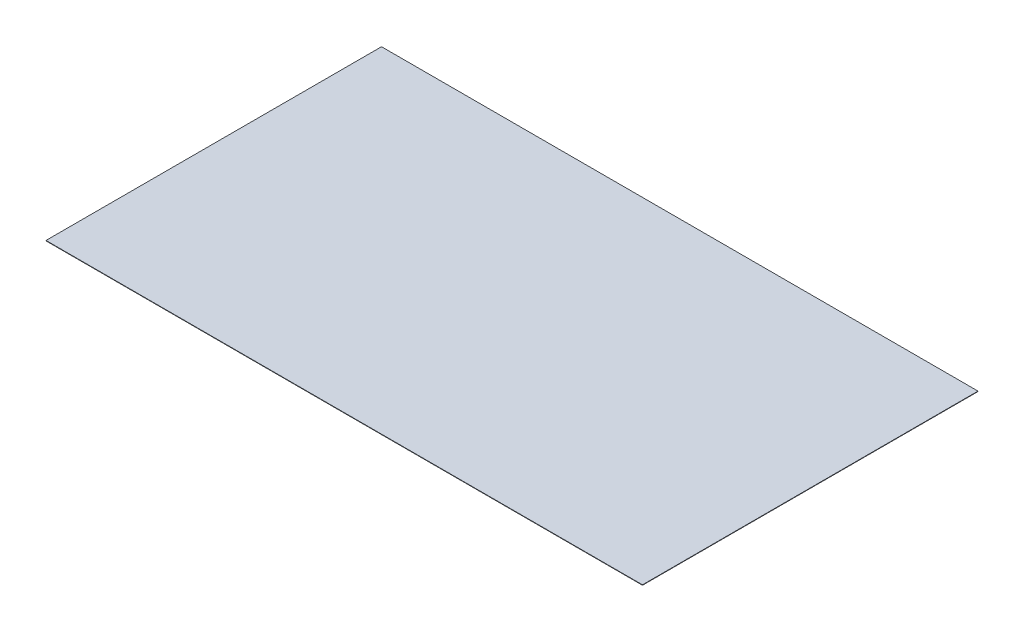
ISO-10303-21;
HEADER;
FILE_DESCRIPTION(('STEP AP214'),'2;1');
FILE_NAME('part.step','',(''),(''),'','','');
FILE_SCHEMA(('AUTOMOTIVE_DESIGN { 1 0 10303 214 1 1 1 1 }'));
ENDSEC;
DATA;
#1=APPLICATION_CONTEXT('core data for automotive mechanical design processes');
#2=APPLICATION_PROTOCOL_DEFINITION('international standard','automotive_design',2000,#1);
#3=PRODUCT_CONTEXT('',#1,'mechanical');
#4=PRODUCT('Part','Part','',(#3));
#5=PRODUCT_RELATED_PRODUCT_CATEGORY('part','',(#4));
#6=PRODUCT_DEFINITION_FORMATION('','',#4);
#7=PRODUCT_DEFINITION_CONTEXT('part definition',#1,'design');
#8=PRODUCT_DEFINITION('design','',#6,#7);
#9=PRODUCT_DEFINITION_SHAPE('','',#8);
#10=(LENGTH_UNIT() NAMED_UNIT(*) SI_UNIT(.MILLI.,.METRE.));
#11=(NAMED_UNIT(*) PLANE_ANGLE_UNIT() SI_UNIT($,.RADIAN.));
#12=(NAMED_UNIT(*) SI_UNIT($,.STERADIAN.) SOLID_ANGLE_UNIT());
#13=UNCERTAINTY_MEASURE_WITH_UNIT(LENGTH_MEASURE(1.E-05),#10,'distance_accuracy_value','');
#14=(GEOMETRIC_REPRESENTATION_CONTEXT(3) GLOBAL_UNCERTAINTY_ASSIGNED_CONTEXT((#13)) GLOBAL_UNIT_ASSIGNED_CONTEXT((#10,
#11,#12)) REPRESENTATION_CONTEXT('',''));
#15=CARTESIAN_POINT('',(0.,0.,0.));
#16=DIRECTION('',(0.,0.,1.));
#17=DIRECTION('',(1.,0.,0.));
#18=AXIS2_PLACEMENT_3D('',#15,#16,#17);
#19=CARTESIAN_POINT('',(0.,2.54,0.));
#20=DIRECTION('',(1.,0.,0.));
#21=DIRECTION('',(0.,0.,-1.));
#22=AXIS2_PLACEMENT_3D('',#19,#20,#21);
#23=PLANE('',#22);
#24=DIRECTION('',(0.,0.,1.));
#25=VECTOR('',#24,1.);
#26=CARTESIAN_POINT('',(0.,0.,0.));
#27=LINE('',#26,#25);
#28=CARTESIAN_POINT('',(0.,0.,0.));
#29=VERTEX_POINT('',#28);
#30=CARTESIAN_POINT('',(2.51958832456576E-13,0.,2057.4));
#31=VERTEX_POINT('',#30);
#32=EDGE_CURVE('E96',#29,#31,#27,.T.);
#33=ORIENTED_EDGE('',*,*,#32,.T.);
#34=DIRECTION('',(0.,-1.,0.));
#35=VECTOR('',#34,1.);
#36=CARTESIAN_POINT('',(2.51958832456576E-13,2.54,2057.4));
#37=LINE('',#36,#35);
#38=CARTESIAN_POINT('',(2.51958832456576E-13,2.54,2057.4));
#39=VERTEX_POINT('',#38);
#40=EDGE_CURVE('E11',#39,#31,#37,.T.);
#41=ORIENTED_EDGE('',*,*,#40,.F.);
#42=DIRECTION('',(0.,0.,1.));
#43=VECTOR('',#42,1.);
#44=CARTESIAN_POINT('',(0.,2.54,0.));
#45=LINE('',#44,#43);
#46=CARTESIAN_POINT('',(0.,2.54,0.));
#47=VERTEX_POINT('',#46);
#48=EDGE_CURVE('E84',#47,#39,#45,.T.);
#49=ORIENTED_EDGE('',*,*,#48,.F.);
#50=DIRECTION('',(0.,-1.,0.));
#51=VECTOR('',#50,1.);
#52=CARTESIAN_POINT('',(0.,2.54,0.));
#53=LINE('',#52,#51);
#54=EDGE_CURVE('E92',#47,#29,#53,.T.);
#55=ORIENTED_EDGE('',*,*,#54,.T.);
#56=EDGE_LOOP('',(#33,#41,#49,#55));
#57=FACE_BOUND('',#56,.T.);
#58=ADVANCED_FACE('F33',(#57),#23,.F.);
#59=CARTESIAN_POINT('',(2.51958832456576E-13,2.54,2057.4));
#60=DIRECTION('',(0.,0.,-1.));
#61=DIRECTION('',(-1.,0.,0.));
#62=AXIS2_PLACEMENT_3D('',#59,#60,#61);
#63=PLANE('',#62);
#64=DIRECTION('',(1.,0.,0.));
#65=VECTOR('',#64,1.);
#66=CARTESIAN_POINT('',(2.51958832456576E-13,0.,2057.4));
#67=LINE('',#66,#65);
#68=CARTESIAN_POINT('',(3657.6,0.,2057.4));
#69=VERTEX_POINT('',#68);
#70=EDGE_CURVE('E88',#31,#69,#67,.T.);
#71=ORIENTED_EDGE('',*,*,#70,.T.);
#72=DIRECTION('',(0.,-1.,0.));
#73=VECTOR('',#72,1.);
#74=CARTESIAN_POINT('',(3657.6,2.54,2057.4));
#75=LINE('',#74,#73);
#76=CARTESIAN_POINT('',(3657.6,2.54,2057.4));
#77=VERTEX_POINT('',#76);
#78=EDGE_CURVE('E41',#77,#69,#75,.T.);
#79=ORIENTED_EDGE('',*,*,#78,.F.);
#80=DIRECTION('',(1.,0.,0.));
#81=VECTOR('',#80,1.);
#82=CARTESIAN_POINT('',(2.51958832456576E-13,2.54,2057.4));
#83=LINE('',#82,#81);
#84=EDGE_CURVE('E79',#39,#77,#83,.T.);
#85=ORIENTED_EDGE('',*,*,#84,.F.);
#86=ORIENTED_EDGE('',*,*,#40,.T.);
#87=EDGE_LOOP('',(#71,#79,#85,#86));
#88=FACE_BOUND('',#87,.T.);
#89=ADVANCED_FACE('F87',(#88),#63,.F.);
#90=CARTESIAN_POINT('',(3657.6,2.54,0.));
#91=DIRECTION('',(-1.,0.,0.));
#92=DIRECTION('',(0.,0.,1.));
#93=AXIS2_PLACEMENT_3D('',#90,#91,#92);
#94=PLANE('',#93);
#95=DIRECTION('',(0.,0.,-1.));
#96=VECTOR('',#95,1.);
#97=CARTESIAN_POINT('',(3657.6,0.,0.));
#98=LINE('',#97,#96);
#99=CARTESIAN_POINT('',(3657.6,0.,0.));
#100=VERTEX_POINT('',#99);
#101=EDGE_CURVE('E66',#69,#100,#98,.T.);
#102=ORIENTED_EDGE('',*,*,#101,.T.);
#103=DIRECTION('',(0.,-1.,0.));
#104=VECTOR('',#103,1.);
#105=CARTESIAN_POINT('',(3657.6,2.54,0.));
#106=LINE('',#105,#104);
#107=CARTESIAN_POINT('',(3657.6,2.54,0.));
#108=VERTEX_POINT('',#107);
#109=EDGE_CURVE('E89',#108,#100,#106,.T.);
#110=ORIENTED_EDGE('',*,*,#109,.F.);
#111=DIRECTION('',(0.,0.,-1.));
#112=VECTOR('',#111,1.);
#113=CARTESIAN_POINT('',(3657.6,2.54,0.));
#114=LINE('',#113,#112);
#115=EDGE_CURVE('E82',#77,#108,#114,.T.);
#116=ORIENTED_EDGE('',*,*,#115,.F.);
#117=ORIENTED_EDGE('',*,*,#78,.T.);
#118=EDGE_LOOP('',(#102,#110,#116,#117));
#119=FACE_BOUND('',#118,.T.);
#120=ADVANCED_FACE('F90',(#119),#94,.F.);
#121=CARTESIAN_POINT('',(0.,2.54,0.));
#122=DIRECTION('',(0.,0.,1.));
#123=DIRECTION('',(1.,0.,0.));
#124=AXIS2_PLACEMENT_3D('',#121,#122,#123);
#125=PLANE('',#124);
#126=DIRECTION('',(-1.,0.,0.));
#127=VECTOR('',#126,1.);
#128=CARTESIAN_POINT('',(0.,0.,0.));
#129=LINE('',#128,#127);
#130=EDGE_CURVE('E72',#100,#29,#129,.T.);
#131=ORIENTED_EDGE('',*,*,#130,.T.);
#132=ORIENTED_EDGE('',*,*,#54,.F.);
#133=DIRECTION('',(-1.,0.,0.));
#134=VECTOR('',#133,1.);
#135=CARTESIAN_POINT('',(0.,2.54,0.));
#136=LINE('',#135,#134);
#137=EDGE_CURVE('E49',#108,#47,#136,.T.);
#138=ORIENTED_EDGE('',*,*,#137,.F.);
#139=ORIENTED_EDGE('',*,*,#109,.T.);
#140=EDGE_LOOP('',(#131,#132,#138,#139));
#141=FACE_BOUND('',#140,.T.);
#142=ADVANCED_FACE('F103',(#141),#125,.F.);
#143=CARTESIAN_POINT('',(0.,2.54,0.));
#144=DIRECTION('',(0.,1.,0.));
#145=DIRECTION('',(0.,0.,1.));
#146=AXIS2_PLACEMENT_3D('',#143,#144,#145);
#147=PLANE('',#146);
#148=ORIENTED_EDGE('',*,*,#48,.T.);
#149=ORIENTED_EDGE('',*,*,#84,.T.);
#150=ORIENTED_EDGE('',*,*,#115,.T.);
#151=ORIENTED_EDGE('',*,*,#137,.T.);
#152=EDGE_LOOP('',(#148,#149,#150,#151));
#153=FACE_BOUND('',#152,.T.);
#154=ADVANCED_FACE('F80',(#153),#147,.T.);
#155=CARTESIAN_POINT('',(0.,0.,0.));
#156=DIRECTION('',(0.,1.,0.));
#157=DIRECTION('',(0.,0.,1.));
#158=AXIS2_PLACEMENT_3D('',#155,#156,#157);
#159=PLANE('',#158);
#160=ORIENTED_EDGE('',*,*,#32,.F.);
#161=ORIENTED_EDGE('',*,*,#130,.F.);
#162=ORIENTED_EDGE('',*,*,#101,.F.);
#163=ORIENTED_EDGE('',*,*,#70,.F.);
#164=EDGE_LOOP('',(#160,#161,#162,#163));
#165=FACE_BOUND('',#164,.T.);
#166=ADVANCED_FACE('F106',(#165),#159,.F.);
#167=CLOSED_SHELL('',(#58,#89,#120,#142,#154,#166));
#168=MANIFOLD_SOLID_BREP('B2',#167);
#169=ADVANCED_BREP_SHAPE_REPRESENTATION('',(#18,#168),#14);
#170=SHAPE_DEFINITION_REPRESENTATION(#9,#169);
ENDSEC;
END-ISO-10303-21;
